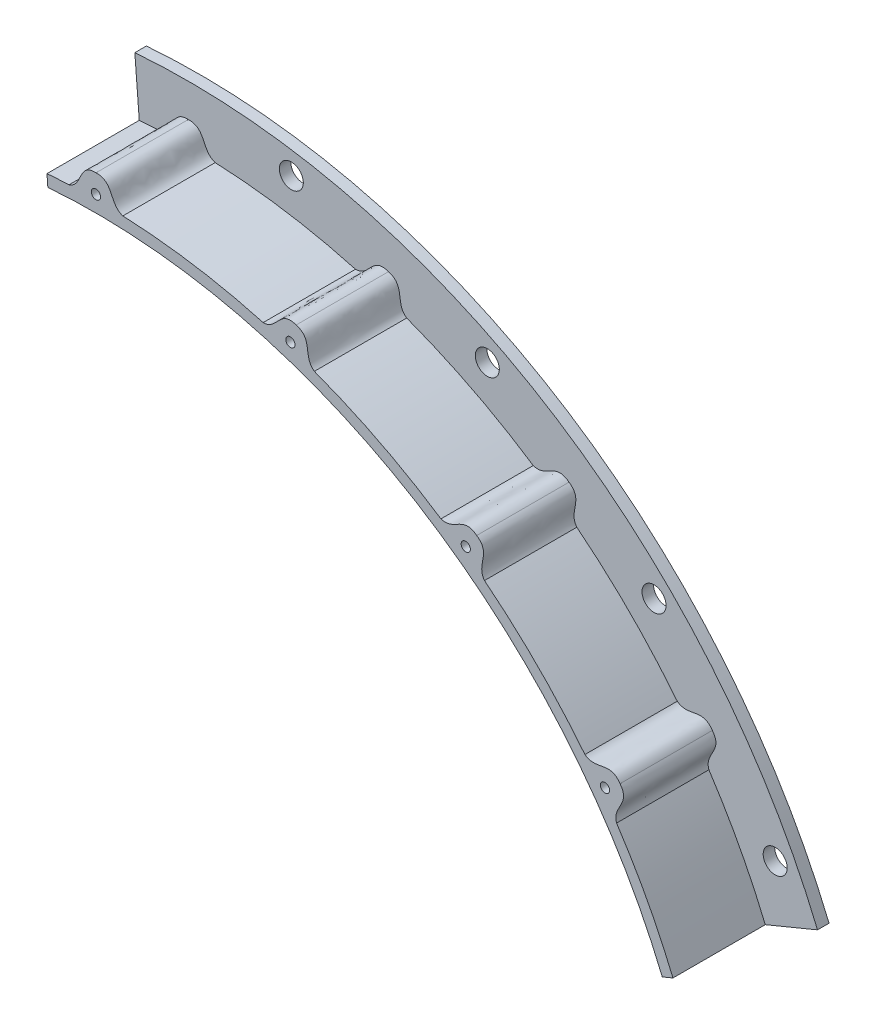
ISO-10303-21;
HEADER;
FILE_DESCRIPTION(('STEP AP214'),'2;1');
FILE_NAME('part.step','',(''),(''),'','','');
FILE_SCHEMA(('AUTOMOTIVE_DESIGN { 1 0 10303 214 1 1 1 1 }'));
ENDSEC;
DATA;
#1=APPLICATION_CONTEXT('core data for automotive mechanical design processes');
#2=APPLICATION_PROTOCOL_DEFINITION('international standard','automotive_design',2000,#1);
#3=PRODUCT_CONTEXT('',#1,'mechanical');
#4=PRODUCT('Part','Part','',(#3));
#5=PRODUCT_RELATED_PRODUCT_CATEGORY('part','',(#4));
#6=PRODUCT_DEFINITION_FORMATION('','',#4);
#7=PRODUCT_DEFINITION_CONTEXT('part definition',#1,'design');
#8=PRODUCT_DEFINITION('design','',#6,#7);
#9=PRODUCT_DEFINITION_SHAPE('','',#8);
#10=(LENGTH_UNIT() NAMED_UNIT(*) SI_UNIT(.MILLI.,.METRE.));
#11=(NAMED_UNIT(*) PLANE_ANGLE_UNIT() SI_UNIT($,.RADIAN.));
#12=(NAMED_UNIT(*) SI_UNIT($,.STERADIAN.) SOLID_ANGLE_UNIT());
#13=UNCERTAINTY_MEASURE_WITH_UNIT(LENGTH_MEASURE(1.E-05),#10,'distance_accuracy_value','');
#14=(GEOMETRIC_REPRESENTATION_CONTEXT(3) GLOBAL_UNCERTAINTY_ASSIGNED_CONTEXT((#13)) GLOBAL_UNIT_ASSIGNED_CONTEXT((#10,
#11,#12)) REPRESENTATION_CONTEXT('',''));
#15=CARTESIAN_POINT('',(0.,0.,0.));
#16=DIRECTION('',(0.,0.,1.));
#17=DIRECTION('',(1.,0.,0.));
#18=AXIS2_PLACEMENT_3D('',#15,#16,#17);
#19=CARTESIAN_POINT('',(0.,0.,3.175));
#20=DIRECTION('',(0.,0.,1.));
#21=DIRECTION('',(1.,0.,0.));
#22=AXIS2_PLACEMENT_3D('',#19,#20,#21);
#23=PLANE('',#22);
#24=CARTESIAN_POINT('',(101.746214957088,140.041650743326,3.175));
#25=DIRECTION('',(0.,0.,1.));
#26=DIRECTION('',(1.,0.,0.));
#27=AXIS2_PLACEMENT_3D('',#24,#25,#26);
#28=CIRCLE('',#27,1.27000000000097);
#29=CARTESIAN_POINT('',(103.016214957089,140.041650743326,3.175));
#30=VERTEX_POINT('',#29);
#31=EDGE_CURVE('E466',#30,#30,#28,.T.);
#32=ORIENTED_EDGE('',*,*,#31,.T.);
#33=EDGE_LOOP('',(#32));
#34=FACE_BOUND('',#33,.T.);
#35=ADVANCED_FACE('F32',(#34),#23,.T.);
#36=CARTESIAN_POINT('',(101.746214957088,140.041650743326,1.27));
#37=DIRECTION('',(0.,0.,1.));
#38=DIRECTION('',(1.,0.,0.));
#39=AXIS2_PLACEMENT_3D('',#36,#37,#38);
#40=CYLINDRICAL_SURFACE('',#39,1.27000000000097);
#41=CARTESIAN_POINT('',(101.746214957088,140.041650743326,28.575));
#42=DIRECTION('',(0.,0.,1.));
#43=DIRECTION('',(1.,0.,0.));
#44=AXIS2_PLACEMENT_3D('',#41,#42,#43);
#45=CIRCLE('',#44,1.27000000000097);
#46=CARTESIAN_POINT('',(103.016214957089,140.041650743326,28.575));
#47=VERTEX_POINT('',#46);
#48=EDGE_CURVE('E519',#47,#47,#45,.T.);
#49=ORIENTED_EDGE('',*,*,#48,.T.);
#50=EDGE_LOOP('',(#49));
#51=FACE_BOUND('',#50,.T.);
#52=ORIENTED_EDGE('',*,*,#31,.F.);
#53=EDGE_LOOP('',(#52));
#54=FACE_BOUND('',#53,.T.);
#55=ADVANCED_FACE('F307',(#51,#54),#40,.F.);
#56=CARTESIAN_POINT('',(140.041650743317,101.746214957118,3.175));
#57=DIRECTION('',(0.,0.,1.));
#58=DIRECTION('',(1.,0.,0.));
#59=AXIS2_PLACEMENT_3D('',#56,#57,#58);
#60=CIRCLE('',#59,1.27000000000818);
#61=CARTESIAN_POINT('',(141.311650743325,101.746214957118,3.175));
#62=VERTEX_POINT('',#61);
#63=EDGE_CURVE('E239',#62,#62,#60,.T.);
#64=ORIENTED_EDGE('',*,*,#63,.T.);
#65=EDGE_LOOP('',(#64));
#66=FACE_BOUND('',#65,.T.);
#67=ADVANCED_FACE('F266',(#66),#23,.T.);
#68=CARTESIAN_POINT('',(140.041650743317,101.746214957118,1.27));
#69=DIRECTION('',(0.,0.,1.));
#70=DIRECTION('',(1.,0.,0.));
#71=AXIS2_PLACEMENT_3D('',#68,#69,#70);
#72=CYLINDRICAL_SURFACE('',#71,1.27000000000818);
#73=CARTESIAN_POINT('',(140.041650743317,101.746214957118,28.575));
#74=DIRECTION('',(0.,0.,1.));
#75=DIRECTION('',(1.,0.,0.));
#76=AXIS2_PLACEMENT_3D('',#73,#74,#75);
#77=CIRCLE('',#76,1.27000000000818);
#78=CARTESIAN_POINT('',(141.311650743325,101.746214957118,28.575));
#79=VERTEX_POINT('',#78);
#80=EDGE_CURVE('E237',#79,#79,#77,.T.);
#81=ORIENTED_EDGE('',*,*,#80,.T.);
#82=EDGE_LOOP('',(#81));
#83=FACE_BOUND('',#82,.T.);
#84=ORIENTED_EDGE('',*,*,#63,.F.);
#85=EDGE_LOOP('',(#84));
#86=FACE_BOUND('',#85,.T.);
#87=ADVANCED_FACE('F262',(#83,#86),#72,.F.);
#88=CARTESIAN_POINT('',(0.,173.101,3.175));
#89=DIRECTION('',(0.,0.,1.));
#90=DIRECTION('',(1.,0.,0.));
#91=AXIS2_PLACEMENT_3D('',#88,#89,#90);
#92=CIRCLE('',#91,1.27);
#93=CARTESIAN_POINT('',(1.27,173.101,3.175));
#94=VERTEX_POINT('',#93);
#95=EDGE_CURVE('E392',#94,#94,#92,.T.);
#96=ORIENTED_EDGE('',*,*,#95,.T.);
#97=EDGE_LOOP('',(#96));
#98=FACE_BOUND('',#97,.T.);
#99=ADVANCED_FACE('F265',(#98),#23,.T.);
#100=CARTESIAN_POINT('',(0.,173.101,1.27));
#101=DIRECTION('',(0.,0.,1.));
#102=DIRECTION('',(1.,0.,0.));
#103=AXIS2_PLACEMENT_3D('',#100,#101,#102);
#104=CYLINDRICAL_SURFACE('',#103,1.27);
#105=CARTESIAN_POINT('',(0.,173.101,28.575));
#106=DIRECTION('',(0.,0.,1.));
#107=DIRECTION('',(1.,0.,0.));
#108=AXIS2_PLACEMENT_3D('',#105,#106,#107);
#109=CIRCLE('',#108,1.27);
#110=CARTESIAN_POINT('',(1.27,173.101,28.575));
#111=VERTEX_POINT('',#110);
#112=EDGE_CURVE('E397',#111,#111,#109,.T.);
#113=ORIENTED_EDGE('',*,*,#112,.T.);
#114=EDGE_LOOP('',(#113));
#115=FACE_BOUND('',#114,.T.);
#116=ORIENTED_EDGE('',*,*,#95,.F.);
#117=EDGE_LOOP('',(#116));
#118=FACE_BOUND('',#117,.T.);
#119=ADVANCED_FACE('F271',(#115,#118),#104,.F.);
#120=CARTESIAN_POINT('',(53.4911507432979,164.628834027207,28.575));
#121=DIRECTION('',(0.,0.,1.));
#122=DIRECTION('',(1.,0.,0.));
#123=AXIS2_PLACEMENT_3D('',#120,#121,#122);
#124=PLANE('',#123);
#125=CARTESIAN_POINT('',(53.4911507433,164.628834027222,28.575));
#126=DIRECTION('',(0.,0.,1.));
#127=DIRECTION('',(1.,0.,0.));
#128=AXIS2_PLACEMENT_3D('',#125,#126,#127);
#129=CIRCLE('',#128,1.26999999999814);
#130=CARTESIAN_POINT('',(54.7611507432982,164.628834027222,28.575));
#131=VERTEX_POINT('',#130);
#132=EDGE_CURVE('E514',#131,#131,#129,.T.);
#133=ORIENTED_EDGE('',*,*,#132,.F.);
#134=EDGE_LOOP('',(#133));
#135=FACE_BOUND('',#134,.T.);
#136=ORIENTED_EDGE('',*,*,#112,.F.);
#137=EDGE_LOOP('',(#136));
#138=FACE_BOUND('',#137,.T.);
#139=CARTESIAN_POINT('',(0.,0.,28.575));
#140=DIRECTION('',(0.,0.,1.));
#141=DIRECTION('',(1.,0.,0.));
#142=AXIS2_PLACEMENT_3D('',#139,#140,#141);
#143=CIRCLE('',#142,171.831);
#144=CARTESIAN_POINT('',(158.751143950947,65.7568768667252,28.575));
#145=VERTEX_POINT('',#144);
#146=CARTESIAN_POINT('',(143.237612225387,94.9151147340747,28.575));
#147=VERTEX_POINT('',#146);
#148=EDGE_CURVE('E200',#145,#147,#143,.T.);
#149=ORIENTED_EDGE('',*,*,#148,.T.);
#150=CARTESIAN_POINT('',(143.237612225387,94.9151147340747,28.575));
#151=CARTESIAN_POINT('',(141.953462812423,98.6504272764381,28.575));
#152=CARTESIAN_POINT('',(147.273074679739,100.866856456998,28.575));
#153=CARTESIAN_POINT('',(144.194459768336,104.763407324454,28.575));
#154=B_SPLINE_CURVE_WITH_KNOTS('',3,(#150,#151,#152,#153),.UNSPECIFIED.,.F.,.F.,(4,4),(0.,1.),.UNSPECIFIED.);
#155=CARTESIAN_POINT('',(144.194459768336,104.763407324454,28.575));
#156=VERTEX_POINT('',#155);
#157=EDGE_CURVE('E41',#147,#156,#154,.T.);
#158=ORIENTED_EDGE('',*,*,#157,.T.);
#159=CARTESIAN_POINT('',(144.194459768336,104.763407324454,28.575));
#160=CARTESIAN_POINT('',(141.439964001522,108.895444534617,28.575));
#161=CARTESIAN_POINT('',(137.688164115939,104.521107287608,28.575));
#162=CARTESIAN_POINT('',(134.532494774054,106.896681009668,28.575));
#163=B_SPLINE_CURVE_WITH_KNOTS('',3,(#159,#160,#161,#162),.UNSPECIFIED.,.F.,.F.,(4,4),(0.,1.),.UNSPECIFIED.);
#164=CARTESIAN_POINT('',(134.532494774054,106.896681009668,28.575));
#165=VERTEX_POINT('',#164);
#166=EDGE_CURVE('E11',#156,#165,#163,.T.);
#167=ORIENTED_EDGE('',*,*,#166,.T.);
#168=CARTESIAN_POINT('',(106.896681009638,134.532494774062,28.575));
#169=VERTEX_POINT('',#168);
#170=EDGE_CURVE('E212',#165,#169,#143,.T.);
#171=ORIENTED_EDGE('',*,*,#170,.T.);
#172=CARTESIAN_POINT('',(106.896681009638,134.532494774062,28.575));
#173=CARTESIAN_POINT('',(104.521107287643,137.688164115959,28.575));
#174=CARTESIAN_POINT('',(108.895444534599,141.439964001522,28.575));
#175=CARTESIAN_POINT('',(104.763407324454,144.194459768336,28.575));
#176=B_SPLINE_CURVE_WITH_KNOTS('',3,(#172,#173,#174,#175),.UNSPECIFIED.,.F.,.F.,(4,4),(0.,1.),.UNSPECIFIED.);
#177=CARTESIAN_POINT('',(104.763407324454,144.194459768336,28.575));
#178=VERTEX_POINT('',#177);
#179=EDGE_CURVE('E476',#169,#178,#176,.T.);
#180=ORIENTED_EDGE('',*,*,#179,.T.);
#181=CARTESIAN_POINT('',(104.763407324454,144.194459768336,28.575));
#182=CARTESIAN_POINT('',(100.866856456989,147.273074679747,28.575));
#183=CARTESIAN_POINT('',(98.6504272764229,141.953462812394,28.575));
#184=CARTESIAN_POINT('',(94.9151147340448,143.237612225396,28.575));
#185=B_SPLINE_CURVE_WITH_KNOTS('',3,(#181,#182,#183,#184),.UNSPECIFIED.,.F.,.F.,(4,4),(0.,1.),.UNSPECIFIED.);
#186=CARTESIAN_POINT('',(94.9151147340448,143.237612225396,28.575));
#187=VERTEX_POINT('',#186);
#188=EDGE_CURVE('E478',#178,#187,#185,.T.);
#189=ORIENTED_EDGE('',*,*,#188,.T.);
#190=CARTESIAN_POINT('',(60.0919578636992,160.980896882557,28.575));
#191=VERTEX_POINT('',#190);
#192=EDGE_CURVE('E207',#187,#191,#143,.T.);
#193=ORIENTED_EDGE('',*,*,#192,.T.);
#194=CARTESIAN_POINT('',(60.0919578636992,160.980896882557,28.575));
#195=CARTESIAN_POINT('',(56.8574975401836,163.248024121961,28.575));
#196=CARTESIAN_POINT('',(59.8583695592363,168.167942399399,28.575));
#197=CARTESIAN_POINT('',(55.0773826420752,169.510753828217,28.575));
#198=B_SPLINE_CURVE_WITH_KNOTS('',3,(#194,#195,#196,#197),.UNSPECIFIED.,.F.,.F.,(4,4),(0.,1.),.UNSPECIFIED.);
#199=CARTESIAN_POINT('',(55.0773826420752,169.510753828217,28.575));
#200=VERTEX_POINT('',#199);
#201=EDGE_CURVE('E501',#191,#200,#198,.T.);
#202=ORIENTED_EDGE('',*,*,#201,.T.);
#203=CARTESIAN_POINT('',(55.0773826420752,169.510753828217,28.575));
#204=CARTESIAN_POINT('',(50.4201982217372,171.234590163375,28.575));
#205=CARTESIAN_POINT('',(49.9560992771343,165.490424349167,28.575));
#206=CARTESIAN_POINT('',(46.0067819513818,165.557447961374,28.575));
#207=B_SPLINE_CURVE_WITH_KNOTS('',3,(#203,#204,#205,#206),.UNSPECIFIED.,.F.,.F.,(4,4),(0.,1.),.UNSPECIFIED.);
#208=CARTESIAN_POINT('',(46.0067819513818,165.557447961374,28.575));
#209=VERTEX_POINT('',#208);
#210=EDGE_CURVE('E502',#200,#209,#207,.T.);
#211=ORIENTED_EDGE('',*,*,#210,.T.);
#212=CARTESIAN_POINT('',(7.40501519677629,171.671367184326,28.575));
#213=VERTEX_POINT('',#212);
#214=EDGE_CURVE('E201',#209,#213,#143,.T.);
#215=ORIENTED_EDGE('',*,*,#214,.T.);
#216=CARTESIAN_POINT('',(7.40501519677629,171.671367184326,28.575));
#217=CARTESIAN_POINT('',(3.62827978401801,172.828030111048,28.575));
#218=CARTESIAN_POINT('',(4.96194031363236,178.43447090027,28.575));
#219=CARTESIAN_POINT('',(0.,178.234154252522,28.575));
#220=B_SPLINE_CURVE_WITH_KNOTS('',3,(#216,#217,#218,#219),.UNSPECIFIED.,.F.,.F.,(4,4),(0.,1.),.UNSPECIFIED.);
#221=CARTESIAN_POINT('',(0.,178.234154252522,28.575));
#222=VERTEX_POINT('',#221);
#223=EDGE_CURVE('E199',#213,#222,#220,.T.);
#224=ORIENTED_EDGE('',*,*,#223,.T.);
#225=CARTESIAN_POINT('',(0.,178.234154252522,28.575));
#226=CARTESIAN_POINT('',(-4.96194031363236,178.43447090027,28.575));
#227=CARTESIAN_POINT('',(-3.62827978401801,172.828030111048,28.575));
#228=CARTESIAN_POINT('',(-7.40501519677629,171.671367184326,28.575));
#229=B_SPLINE_CURVE_WITH_KNOTS('',3,(#225,#226,#227,#228),.UNSPECIFIED.,.F.,.F.,(4,4),(0.,1.),.UNSPECIFIED.);
#230=CARTESIAN_POINT('',(-7.40501519677629,171.671367184326,28.575));
#231=VERTEX_POINT('',#230);
#232=EDGE_CURVE('E504',#222,#231,#229,.T.);
#233=ORIENTED_EDGE('',*,*,#232,.T.);
#234=CARTESIAN_POINT('',(-13.4817048780114,171.301302372697,28.575));
#235=VERTEX_POINT('',#234);
#236=EDGE_CURVE('E198',#231,#235,#143,.T.);
#237=ORIENTED_EDGE('',*,*,#236,.T.);
#238=DIRECTION('',(0.0784590957278451,-0.996917333733128,0.));
#239=VECTOR('',#238,1.);
#240=CARTESIAN_POINT('',(0.,0.,28.575));
#241=LINE('',#240,#239);
#242=CARTESIAN_POINT('',(-13.2325972490754,168.136089838094,28.575));
#243=VERTEX_POINT('',#242);
#244=EDGE_CURVE('E56',#235,#243,#241,.T.);
#245=ORIENTED_EDGE('',*,*,#244,.T.);
#246=CARTESIAN_POINT('',(0.,0.,28.575));
#247=DIRECTION('',(0.,0.,-1.));
#248=DIRECTION('',(-1.,0.,0.));
#249=AXIS2_PLACEMENT_3D('',#246,#247,#248);
#250=CIRCLE('',#249,168.656);
#251=CARTESIAN_POINT('',(155.817826435224,64.541856968966,28.575));
#252=VERTEX_POINT('',#251);
#253=EDGE_CURVE('E204',#243,#252,#250,.T.);
#254=ORIENTED_EDGE('',*,*,#253,.T.);
#255=DIRECTION('',(0.923879532511288,0.382683432365086,0.));
#256=VECTOR('',#255,1.);
#257=CARTESIAN_POINT('',(0.,0.,28.575));
#258=LINE('',#257,#256);
#259=EDGE_CURVE('E36',#252,#145,#258,.T.);
#260=ORIENTED_EDGE('',*,*,#259,.T.);
#261=EDGE_LOOP('',(#149,#158,#167,#171,#180,#189,#193,#202,#211,#215,#224,#233,#237,#245,#254,#260));
#262=FACE_BOUND('',#261,.T.);
#263=ORIENTED_EDGE('',*,*,#48,.F.);
#264=EDGE_LOOP('',(#263));
#265=FACE_BOUND('',#264,.T.);
#266=ORIENTED_EDGE('',*,*,#80,.F.);
#267=EDGE_LOOP('',(#266));
#268=FACE_BOUND('',#267,.T.);
#269=ADVANCED_FACE('F221',(#135,#138,#262,#265,#268),#124,.T.);
#270=CARTESIAN_POINT('',(53.4911507433,164.628834027222,3.175));
#271=DIRECTION('',(0.,0.,1.));
#272=DIRECTION('',(1.,0.,0.));
#273=AXIS2_PLACEMENT_3D('',#270,#271,#272);
#274=CIRCLE('',#273,1.26999999999814);
#275=CARTESIAN_POINT('',(54.7611507432982,164.628834027222,3.175));
#276=VERTEX_POINT('',#275);
#277=EDGE_CURVE('E485',#276,#276,#274,.T.);
#278=ORIENTED_EDGE('',*,*,#277,.T.);
#279=EDGE_LOOP('',(#278));
#280=FACE_BOUND('',#279,.T.);
#281=ADVANCED_FACE('F270',(#280),#23,.T.);
#282=CARTESIAN_POINT('',(53.4911507433,164.628834027222,1.27));
#283=DIRECTION('',(0.,0.,1.));
#284=DIRECTION('',(1.,0.,0.));
#285=AXIS2_PLACEMENT_3D('',#282,#283,#284);
#286=CYLINDRICAL_SURFACE('',#285,1.26999999999814);
#287=ORIENTED_EDGE('',*,*,#132,.T.);
#288=EDGE_LOOP('',(#287));
#289=FACE_BOUND('',#288,.T.);
#290=ORIENTED_EDGE('',*,*,#277,.F.);
#291=EDGE_LOOP('',(#290));
#292=FACE_BOUND('',#291,.T.);
#293=ADVANCED_FACE('F273',(#289,#292),#286,.F.);
#294=CARTESIAN_POINT('',(0.,0.,-0.0100000000000031));
#295=DIRECTION('',(-0.996917333733128,-0.0784590957278451,0.));
#296=DIRECTION('',(0.0784590957278451,-0.996917333733128,0.));
#297=AXIS2_PLACEMENT_3D('',#294,#295,#296);
#298=PLANE('',#297);
#299=ORIENTED_EDGE('',*,*,#244,.F.);
#300=DIRECTION('',(0.,0.,-1.));
#301=VECTOR('',#300,1.);
#302=CARTESIAN_POINT('',(-13.4817048780114,171.301302372697,28.575));
#303=LINE('',#302,#301);
#304=CARTESIAN_POINT('',(-13.4817048780114,171.301302372697,3.175));
#305=VERTEX_POINT('',#304);
#306=EDGE_CURVE('E165',#235,#305,#303,.T.);
#307=ORIENTED_EDGE('',*,*,#306,.T.);
#308=DIRECTION('',(0.0784590957278451,-0.996917333733128,0.));
#309=VECTOR('',#308,1.);
#310=CARTESIAN_POINT('',(0.,0.,3.175));
#311=LINE('',#310,#309);
#312=CARTESIAN_POINT('',(-14.7023322597973,186.81084379225,3.175));
#313=VERTEX_POINT('',#312);
#314=EDGE_CURVE('E175',#313,#305,#311,.T.);
#315=ORIENTED_EDGE('',*,*,#314,.F.);
#316=DIRECTION('',(0.,0.,-1.));
#317=VECTOR('',#316,1.);
#318=CARTESIAN_POINT('',(-14.7023322597973,186.81084379225,3.175));
#319=LINE('',#318,#317);
#320=CARTESIAN_POINT('',(-14.7023322597973,186.81084379225,0.));
#321=VERTEX_POINT('',#320);
#322=EDGE_CURVE('E188',#313,#321,#319,.T.);
#323=ORIENTED_EDGE('',*,*,#322,.T.);
#324=DIRECTION('',(0.0784590957278451,-0.996917333733128,0.));
#325=VECTOR('',#324,1.);
#326=CARTESIAN_POINT('',(0.,0.,0.));
#327=LINE('',#326,#325);
#328=CARTESIAN_POINT('',(-13.2325972490754,168.136089838094,0.));
#329=VERTEX_POINT('',#328);
#330=EDGE_CURVE('E752',#321,#329,#327,.T.);
#331=ORIENTED_EDGE('',*,*,#330,.T.);
#332=DIRECTION('',(0.,0.,-1.));
#333=VECTOR('',#332,1.);
#334=CARTESIAN_POINT('',(-13.2325972490754,168.136089838094,3.175));
#335=LINE('',#334,#333);
#336=EDGE_CURVE('E758',#243,#329,#335,.T.);
#337=ORIENTED_EDGE('',*,*,#336,.F.);
#338=EDGE_LOOP('',(#299,#307,#315,#323,#331,#337));
#339=FACE_BOUND('',#338,.T.);
#340=ADVANCED_FACE('F184',(#339),#298,.T.);
#341=CARTESIAN_POINT('',(0.,0.,-0.0100000000000031));
#342=DIRECTION('',(0.382683432365086,-0.923879532511288,0.));
#343=DIRECTION('',(0.923879532511288,0.382683432365086,0.));
#344=AXIS2_PLACEMENT_3D('',#341,#342,#343);
#345=PLANE('',#344);
#346=ORIENTED_EDGE('',*,*,#259,.F.);
#347=DIRECTION('',(0.,0.,-1.));
#348=VECTOR('',#347,1.);
#349=CARTESIAN_POINT('',(155.817826435224,64.541856968966,3.175));
#350=LINE('',#349,#348);
#351=CARTESIAN_POINT('',(155.817826435224,64.541856968966,0.));
#352=VERTEX_POINT('',#351);
#353=EDGE_CURVE('E194',#352,#252,#350,.F.);
#354=ORIENTED_EDGE('',*,*,#353,.F.);
#355=DIRECTION('',(0.923879532511288,0.382683432365086,0.));
#356=VECTOR('',#355,1.);
#357=CARTESIAN_POINT('',(0.,0.,0.));
#358=LINE('',#357,#356);
#359=CARTESIAN_POINT('',(173.124399777992,71.710474365745,0.));
#360=VERTEX_POINT('',#359);
#361=EDGE_CURVE('E750',#352,#360,#358,.T.);
#362=ORIENTED_EDGE('',*,*,#361,.T.);
#363=DIRECTION('',(0.,0.,-1.));
#364=VECTOR('',#363,1.);
#365=CARTESIAN_POINT('',(173.124399777992,71.710474365745,3.175));
#366=LINE('',#365,#364);
#367=CARTESIAN_POINT('',(173.124399777992,71.710474365745,3.175));
#368=VERTEX_POINT('',#367);
#369=EDGE_CURVE('E185',#360,#368,#366,.F.);
#370=ORIENTED_EDGE('',*,*,#369,.T.);
#371=DIRECTION('',(0.923879532511288,0.382683432365086,0.));
#372=VECTOR('',#371,1.);
#373=CARTESIAN_POINT('',(0.,0.,3.175));
#374=LINE('',#373,#372);
#375=CARTESIAN_POINT('',(158.751143950947,65.7568768667252,3.175));
#376=VERTEX_POINT('',#375);
#377=EDGE_CURVE('E181',#376,#368,#374,.T.);
#378=ORIENTED_EDGE('',*,*,#377,.F.);
#379=DIRECTION('',(0.,0.,-1.));
#380=VECTOR('',#379,1.);
#381=CARTESIAN_POINT('',(158.751143950947,65.7568768667252,28.575));
#382=LINE('',#381,#380);
#383=EDGE_CURVE('E182',#376,#145,#382,.F.);
#384=ORIENTED_EDGE('',*,*,#383,.T.);
#385=EDGE_LOOP('',(#346,#354,#362,#370,#378,#384));
#386=FACE_BOUND('',#385,.T.);
#387=ADVANCED_FACE('F289',(#386),#345,.T.);
#388=CARTESIAN_POINT('',(0.,0.,28.575));
#389=DIRECTION('',(0.,0.,-1.));
#390=DIRECTION('',(-1.,0.,0.));
#391=AXIS2_PLACEMENT_3D('',#388,#389,#390);
#392=CYLINDRICAL_SURFACE('',#391,171.831);
#393=ORIENTED_EDGE('',*,*,#383,.F.);
#394=CARTESIAN_POINT('',(0.,0.,3.175));
#395=DIRECTION('',(0.,0.,1.));
#396=DIRECTION('',(1.,0.,0.));
#397=AXIS2_PLACEMENT_3D('',#394,#395,#396);
#398=CIRCLE('',#397,171.831);
#399=CARTESIAN_POINT('',(143.237612225387,94.9151147340747,3.175));
#400=VERTEX_POINT('',#399);
#401=EDGE_CURVE('E170',#376,#400,#398,.T.);
#402=ORIENTED_EDGE('',*,*,#401,.T.);
#403=DIRECTION('',(0.,0.,1.));
#404=VECTOR('',#403,1.);
#405=CARTESIAN_POINT('',(143.237612225387,94.9151147340747,1.27));
#406=LINE('',#405,#404);
#407=EDGE_CURVE('E228',#400,#147,#406,.T.);
#408=ORIENTED_EDGE('',*,*,#407,.T.);
#409=ORIENTED_EDGE('',*,*,#148,.F.);
#410=EDGE_LOOP('',(#393,#402,#408,#409));
#411=FACE_BOUND('',#410,.T.);
#412=ADVANCED_FACE('F229',(#411),#392,.T.);
#413=CARTESIAN_POINT('',(28.3504616647761,178.997770277716,3.175));
#414=DIRECTION('',(0.,0.,1.));
#415=DIRECTION('',(1.,0.,0.));
#416=AXIS2_PLACEMENT_3D('',#413,#414,#415);
#417=CIRCLE('',#416,3.30199999999999);
#418=CARTESIAN_POINT('',(31.6524616647761,178.997770277716,3.175));
#419=VERTEX_POINT('',#418);
#420=EDGE_CURVE('E772',#419,#419,#417,.T.);
#421=ORIENTED_EDGE('',*,*,#420,.F.);
#422=EDGE_LOOP('',(#421));
#423=FACE_BOUND('',#422,.T.);
#424=CARTESIAN_POINT('',(161.476221372138,82.2762442773039,3.175));
#425=DIRECTION('',(0.,0.,1.));
#426=DIRECTION('',(1.,0.,0.));
#427=AXIS2_PLACEMENT_3D('',#424,#425,#426);
#428=CIRCLE('',#427,3.30200000000161);
#429=CARTESIAN_POINT('',(164.778221372139,82.2762442773039,3.175));
#430=VERTEX_POINT('',#429);
#431=EDGE_CURVE('E775',#430,#430,#428,.T.);
#432=ORIENTED_EDGE('',*,*,#431,.F.);
#433=EDGE_LOOP('',(#432));
#434=FACE_BOUND('',#433,.T.);
#435=CARTESIAN_POINT('',(128.148254847659,128.148254847661,3.175));
#436=DIRECTION('',(0.,0.,1.));
#437=DIRECTION('',(1.,0.,0.));
#438=AXIS2_PLACEMENT_3D('',#435,#436,#437);
#439=CIRCLE('',#438,3.30200000000034);
#440=CARTESIAN_POINT('',(131.450254847659,128.148254847661,3.175));
#441=VERTEX_POINT('',#440);
#442=EDGE_CURVE('E778',#441,#441,#439,.T.);
#443=ORIENTED_EDGE('',*,*,#442,.F.);
#444=EDGE_LOOP('',(#443));
#445=FACE_BOUND('',#444,.T.);
#446=CARTESIAN_POINT('',(82.2762442772985,161.476221372134,3.175));
#447=DIRECTION('',(0.,0.,1.));
#448=DIRECTION('',(1.,0.,0.));
#449=AXIS2_PLACEMENT_3D('',#446,#447,#448);
#450=CIRCLE('',#449,3.302);
#451=CARTESIAN_POINT('',(85.5782442772985,161.476221372134,3.175));
#452=VERTEX_POINT('',#451);
#453=EDGE_CURVE('E780',#452,#452,#450,.T.);
#454=ORIENTED_EDGE('',*,*,#453,.F.);
#455=EDGE_LOOP('',(#454));
#456=FACE_BOUND('',#455,.T.);
#457=CARTESIAN_POINT('',(0.,0.,3.175));
#458=DIRECTION('',(0.,0.,1.));
#459=DIRECTION('',(1.,0.,0.));
#460=AXIS2_PLACEMENT_3D('',#457,#458,#459);
#461=CIRCLE('',#460,187.3885);
#462=EDGE_CURVE('E178',#368,#313,#461,.T.);
#463=ORIENTED_EDGE('',*,*,#462,.T.);
#464=ORIENTED_EDGE('',*,*,#314,.T.);
#465=CARTESIAN_POINT('',(-7.40501519677629,171.671367184326,3.175));
#466=VERTEX_POINT('',#465);
#467=EDGE_CURVE('E162',#466,#305,#398,.T.);
#468=ORIENTED_EDGE('',*,*,#467,.F.);
#469=CARTESIAN_POINT('',(0.,178.234154252522,3.175));
#470=CARTESIAN_POINT('',(-4.96194031363236,178.43447090027,3.175));
#471=CARTESIAN_POINT('',(-3.62827978401801,172.828030111048,3.175));
#472=CARTESIAN_POINT('',(-7.40501519677629,171.671367184326,3.175));
#473=B_SPLINE_CURVE_WITH_KNOTS('',3,(#469,#470,#471,#472),.UNSPECIFIED.,.F.,.F.,(4,4),(0.,1.),.UNSPECIFIED.);
#474=CARTESIAN_POINT('',(0.,178.234154252522,3.175));
#475=VERTEX_POINT('',#474);
#476=EDGE_CURVE('E384',#475,#466,#473,.T.);
#477=ORIENTED_EDGE('',*,*,#476,.F.);
#478=CARTESIAN_POINT('',(7.40501519677629,171.671367184326,3.175));
#479=CARTESIAN_POINT('',(3.62827978401801,172.828030111048,3.175));
#480=CARTESIAN_POINT('',(4.96194031363236,178.43447090027,3.175));
#481=CARTESIAN_POINT('',(0.,178.234154252522,3.175));
#482=B_SPLINE_CURVE_WITH_KNOTS('',3,(#478,#479,#480,#481),.UNSPECIFIED.,.F.,.F.,(4,4),(0.,1.),.UNSPECIFIED.);
#483=CARTESIAN_POINT('',(7.40501519677629,171.671367184326,3.175));
#484=VERTEX_POINT('',#483);
#485=EDGE_CURVE('E388',#484,#475,#482,.T.);
#486=ORIENTED_EDGE('',*,*,#485,.F.);
#487=CARTESIAN_POINT('',(46.0067819513818,165.557447961374,3.175));
#488=VERTEX_POINT('',#487);
#489=EDGE_CURVE('E173',#488,#484,#398,.T.);
#490=ORIENTED_EDGE('',*,*,#489,.F.);
#491=CARTESIAN_POINT('',(55.0773826420752,169.510753828217,3.175));
#492=CARTESIAN_POINT('',(50.4201982217372,171.234590163375,3.175));
#493=CARTESIAN_POINT('',(49.9560992771343,165.490424349167,3.175));
#494=CARTESIAN_POINT('',(46.0067819513818,165.557447961374,3.175));
#495=B_SPLINE_CURVE_WITH_KNOTS('',3,(#491,#492,#493,#494),.UNSPECIFIED.,.F.,.F.,(4,4),(0.,1.),.UNSPECIFIED.);
#496=CARTESIAN_POINT('',(55.0773826420752,169.510753828217,3.175));
#497=VERTEX_POINT('',#496);
#498=EDGE_CURVE('E412',#497,#488,#495,.T.);
#499=ORIENTED_EDGE('',*,*,#498,.F.);
#500=CARTESIAN_POINT('',(60.0919578636992,160.980896882557,3.175));
#501=CARTESIAN_POINT('',(56.8574975401836,163.248024121961,3.175));
#502=CARTESIAN_POINT('',(59.8583695592363,168.167942399399,3.175));
#503=CARTESIAN_POINT('',(55.0773826420752,169.510753828217,3.175));
#504=B_SPLINE_CURVE_WITH_KNOTS('',3,(#500,#501,#502,#503),.UNSPECIFIED.,.F.,.F.,(4,4),(0.,1.),.UNSPECIFIED.);
#505=CARTESIAN_POINT('',(60.0919578636992,160.980896882557,3.175));
#506=VERTEX_POINT('',#505);
#507=EDGE_CURVE('E481',#506,#497,#504,.T.);
#508=ORIENTED_EDGE('',*,*,#507,.F.);
#509=CARTESIAN_POINT('',(94.9151147340448,143.237612225396,3.175));
#510=VERTEX_POINT('',#509);
#511=EDGE_CURVE('E379',#510,#506,#398,.T.);
#512=ORIENTED_EDGE('',*,*,#511,.F.);
#513=CARTESIAN_POINT('',(104.763407324454,144.194459768336,3.175));
#514=CARTESIAN_POINT('',(100.866856456989,147.273074679747,3.175));
#515=CARTESIAN_POINT('',(98.6504272764229,141.953462812394,3.175));
#516=CARTESIAN_POINT('',(94.9151147340448,143.237612225396,3.175));
#517=B_SPLINE_CURVE_WITH_KNOTS('',3,(#513,#514,#515,#516),.UNSPECIFIED.,.F.,.F.,(4,4),(0.,1.),.UNSPECIFIED.);
#518=CARTESIAN_POINT('',(104.763407324454,144.194459768336,3.175));
#519=VERTEX_POINT('',#518);
#520=EDGE_CURVE('E452',#519,#510,#517,.T.);
#521=ORIENTED_EDGE('',*,*,#520,.F.);
#522=CARTESIAN_POINT('',(106.896681009638,134.532494774062,3.175));
#523=CARTESIAN_POINT('',(104.521107287643,137.688164115959,3.175));
#524=CARTESIAN_POINT('',(108.895444534599,141.439964001522,3.175));
#525=CARTESIAN_POINT('',(104.763407324454,144.194459768336,3.175));
#526=B_SPLINE_CURVE_WITH_KNOTS('',3,(#522,#523,#524,#525),.UNSPECIFIED.,.F.,.F.,(4,4),(0.,1.),.UNSPECIFIED.);
#527=CARTESIAN_POINT('',(106.896681009638,134.532494774062,3.175));
#528=VERTEX_POINT('',#527);
#529=EDGE_CURVE('E376',#528,#519,#526,.T.);
#530=ORIENTED_EDGE('',*,*,#529,.F.);
#531=CARTESIAN_POINT('',(134.532494774054,106.896681009668,3.175));
#532=VERTEX_POINT('',#531);
#533=EDGE_CURVE('E374',#532,#528,#398,.T.);
#534=ORIENTED_EDGE('',*,*,#533,.F.);
#535=CARTESIAN_POINT('',(144.194459768336,104.763407324454,3.175));
#536=CARTESIAN_POINT('',(141.439964001522,108.895444534617,3.175));
#537=CARTESIAN_POINT('',(137.688164115939,104.521107287608,3.175));
#538=CARTESIAN_POINT('',(134.532494774054,106.896681009668,3.175));
#539=B_SPLINE_CURVE_WITH_KNOTS('',3,(#535,#536,#537,#538),.UNSPECIFIED.,.F.,.F.,(4,4),(0.,1.),.UNSPECIFIED.);
#540=CARTESIAN_POINT('',(144.194459768336,104.763407324454,3.175));
#541=VERTEX_POINT('',#540);
#542=EDGE_CURVE('E348',#541,#532,#539,.T.);
#543=ORIENTED_EDGE('',*,*,#542,.F.);
#544=CARTESIAN_POINT('',(143.237612225387,94.9151147340747,3.175));
#545=CARTESIAN_POINT('',(141.953462812423,98.6504272764381,3.175));
#546=CARTESIAN_POINT('',(147.273074679739,100.866856456998,3.175));
#547=CARTESIAN_POINT('',(144.194459768336,104.763407324454,3.175));
#548=B_SPLINE_CURVE_WITH_KNOTS('',3,(#544,#545,#546,#547),.UNSPECIFIED.,.F.,.F.,(4,4),(0.,1.),.UNSPECIFIED.);
#549=EDGE_CURVE('E355',#400,#541,#548,.T.);
#550=ORIENTED_EDGE('',*,*,#549,.F.);
#551=ORIENTED_EDGE('',*,*,#401,.F.);
#552=ORIENTED_EDGE('',*,*,#377,.T.);
#553=EDGE_LOOP('',(#463,#464,#468,#477,#486,#490,#499,#508,#512,#521,#530,#534,#543,#550,#551,#552));
#554=FACE_BOUND('',#553,.T.);
#555=ADVANCED_FACE('F176',(#423,#434,#445,#456,#554),#23,.T.);
#556=CARTESIAN_POINT('',(0.,0.,0.));
#557=DIRECTION('',(0.,0.,1.));
#558=DIRECTION('',(1.,0.,0.));
#559=AXIS2_PLACEMENT_3D('',#556,#557,#558);
#560=PLANE('',#559);
#561=CARTESIAN_POINT('',(28.3504616647761,178.997770277716,0.));
#562=DIRECTION('',(0.,0.,1.));
#563=DIRECTION('',(1.,0.,0.));
#564=AXIS2_PLACEMENT_3D('',#561,#562,#563);
#565=CIRCLE('',#564,3.30199999999999);
#566=CARTESIAN_POINT('',(31.6524616647761,178.997770277716,0.));
#567=VERTEX_POINT('',#566);
#568=EDGE_CURVE('E765',#567,#567,#565,.T.);
#569=ORIENTED_EDGE('',*,*,#568,.T.);
#570=EDGE_LOOP('',(#569));
#571=FACE_BOUND('',#570,.T.);
#572=CARTESIAN_POINT('',(161.476221372138,82.2762442773039,0.));
#573=DIRECTION('',(0.,0.,1.));
#574=DIRECTION('',(1.,0.,0.));
#575=AXIS2_PLACEMENT_3D('',#572,#573,#574);
#576=CIRCLE('',#575,3.30200000000161);
#577=CARTESIAN_POINT('',(164.778221372139,82.2762442773039,0.));
#578=VERTEX_POINT('',#577);
#579=EDGE_CURVE('E203',#578,#578,#576,.T.);
#580=ORIENTED_EDGE('',*,*,#579,.T.);
#581=EDGE_LOOP('',(#580));
#582=FACE_BOUND('',#581,.T.);
#583=CARTESIAN_POINT('',(128.148254847659,128.148254847661,0.));
#584=DIRECTION('',(0.,0.,1.));
#585=DIRECTION('',(1.,0.,0.));
#586=AXIS2_PLACEMENT_3D('',#583,#584,#585);
#587=CIRCLE('',#586,3.30200000000034);
#588=CARTESIAN_POINT('',(131.450254847659,128.148254847661,0.));
#589=VERTEX_POINT('',#588);
#590=EDGE_CURVE('E764',#589,#589,#587,.T.);
#591=ORIENTED_EDGE('',*,*,#590,.T.);
#592=EDGE_LOOP('',(#591));
#593=FACE_BOUND('',#592,.T.);
#594=CARTESIAN_POINT('',(82.2762442772985,161.476221372134,0.));
#595=DIRECTION('',(0.,0.,1.));
#596=DIRECTION('',(1.,0.,0.));
#597=AXIS2_PLACEMENT_3D('',#594,#595,#596);
#598=CIRCLE('',#597,3.302);
#599=CARTESIAN_POINT('',(85.5782442772985,161.476221372134,0.));
#600=VERTEX_POINT('',#599);
#601=EDGE_CURVE('E761',#600,#600,#598,.T.);
#602=ORIENTED_EDGE('',*,*,#601,.T.);
#603=EDGE_LOOP('',(#602));
#604=FACE_BOUND('',#603,.T.);
#605=ORIENTED_EDGE('',*,*,#330,.F.);
#606=CARTESIAN_POINT('',(0.,0.,0.));
#607=DIRECTION('',(0.,0.,1.));
#608=DIRECTION('',(1.,0.,0.));
#609=AXIS2_PLACEMENT_3D('',#606,#607,#608);
#610=CIRCLE('',#609,187.3885);
#611=EDGE_CURVE('E193',#360,#321,#610,.T.);
#612=ORIENTED_EDGE('',*,*,#611,.F.);
#613=ORIENTED_EDGE('',*,*,#361,.F.);
#614=CARTESIAN_POINT('',(0.,0.,0.));
#615=DIRECTION('',(0.,0.,1.));
#616=DIRECTION('',(1.,0.,0.));
#617=AXIS2_PLACEMENT_3D('',#614,#615,#616);
#618=CIRCLE('',#617,168.656);
#619=EDGE_CURVE('E171',#352,#329,#618,.T.);
#620=ORIENTED_EDGE('',*,*,#619,.T.);
#621=EDGE_LOOP('',(#605,#612,#613,#620));
#622=FACE_BOUND('',#621,.T.);
#623=ADVANCED_FACE('F297',(#571,#582,#593,#604,#622),#560,.F.);
#624=CARTESIAN_POINT('',(0.,0.,3.175));
#625=DIRECTION('',(0.,0.,-1.));
#626=DIRECTION('',(-1.,0.,0.));
#627=AXIS2_PLACEMENT_3D('',#624,#625,#626);
#628=CYLINDRICAL_SURFACE('',#627,187.3885);
#629=ORIENTED_EDGE('',*,*,#322,.F.);
#630=ORIENTED_EDGE('',*,*,#462,.F.);
#631=ORIENTED_EDGE('',*,*,#369,.F.);
#632=ORIENTED_EDGE('',*,*,#611,.T.);
#633=EDGE_LOOP('',(#629,#630,#631,#632));
#634=FACE_BOUND('',#633,.T.);
#635=ADVANCED_FACE('F34',(#634),#628,.T.);
#636=CARTESIAN_POINT('',(0.,0.,3.175));
#637=DIRECTION('',(0.,0.,-1.));
#638=DIRECTION('',(-1.,0.,0.));
#639=AXIS2_PLACEMENT_3D('',#636,#637,#638);
#640=CYLINDRICAL_SURFACE('',#639,168.656);
#641=ORIENTED_EDGE('',*,*,#253,.F.);
#642=ORIENTED_EDGE('',*,*,#336,.T.);
#643=ORIENTED_EDGE('',*,*,#619,.F.);
#644=ORIENTED_EDGE('',*,*,#353,.T.);
#645=EDGE_LOOP('',(#641,#642,#643,#644));
#646=FACE_BOUND('',#645,.T.);
#647=ADVANCED_FACE('F302',(#646),#640,.F.);
#648=ORIENTED_EDGE('',*,*,#306,.F.);
#649=ORIENTED_EDGE('',*,*,#236,.F.);
#650=DIRECTION('',(0.,0.,1.));
#651=VECTOR('',#650,1.);
#652=CARTESIAN_POINT('',(-7.40501519677629,171.671367184326,1.27));
#653=LINE('',#652,#651);
#654=EDGE_CURVE('E167',#466,#231,#653,.T.);
#655=ORIENTED_EDGE('',*,*,#654,.F.);
#656=ORIENTED_EDGE('',*,*,#467,.T.);
#657=EDGE_LOOP('',(#648,#649,#655,#656));
#658=FACE_BOUND('',#657,.T.);
#659=ADVANCED_FACE('F164',(#658),#392,.T.);
#660=ORIENTED_EDGE('',*,*,#170,.F.);
#661=DIRECTION('',(0.,0.,1.));
#662=VECTOR('',#661,1.);
#663=CARTESIAN_POINT('',(134.532494774054,106.896681009668,1.27));
#664=LINE('',#663,#662);
#665=EDGE_CURVE('E233',#532,#165,#664,.T.);
#666=ORIENTED_EDGE('',*,*,#665,.F.);
#667=ORIENTED_EDGE('',*,*,#533,.T.);
#668=DIRECTION('',(0.,0.,1.));
#669=VECTOR('',#668,1.);
#670=CARTESIAN_POINT('',(106.896681009638,134.532494774062,1.27));
#671=LINE('',#670,#669);
#672=EDGE_CURVE('E473',#528,#169,#671,.T.);
#673=ORIENTED_EDGE('',*,*,#672,.T.);
#674=EDGE_LOOP('',(#660,#666,#667,#673));
#675=FACE_BOUND('',#674,.T.);
#676=ADVANCED_FACE('F315',(#675),#392,.T.);
#677=ORIENTED_EDGE('',*,*,#192,.F.);
#678=DIRECTION('',(0.,0.,1.));
#679=VECTOR('',#678,1.);
#680=CARTESIAN_POINT('',(94.9151147340448,143.237612225396,1.27));
#681=LINE('',#680,#679);
#682=EDGE_CURVE('E356',#510,#187,#681,.T.);
#683=ORIENTED_EDGE('',*,*,#682,.F.);
#684=ORIENTED_EDGE('',*,*,#511,.T.);
#685=DIRECTION('',(0.,0.,1.));
#686=VECTOR('',#685,1.);
#687=CARTESIAN_POINT('',(60.0919578636992,160.980896882557,1.27));
#688=LINE('',#687,#686);
#689=EDGE_CURVE('E500',#506,#191,#688,.T.);
#690=ORIENTED_EDGE('',*,*,#689,.T.);
#691=EDGE_LOOP('',(#677,#683,#684,#690));
#692=FACE_BOUND('',#691,.T.);
#693=ADVANCED_FACE('F312',(#692),#392,.T.);
#694=ORIENTED_EDGE('',*,*,#214,.F.);
#695=DIRECTION('',(0.,0.,1.));
#696=VECTOR('',#695,1.);
#697=CARTESIAN_POINT('',(46.0067819513818,165.557447961374,1.27));
#698=LINE('',#697,#696);
#699=EDGE_CURVE('E459',#488,#209,#698,.T.);
#700=ORIENTED_EDGE('',*,*,#699,.F.);
#701=ORIENTED_EDGE('',*,*,#489,.T.);
#702=DIRECTION('',(0.,0.,1.));
#703=VECTOR('',#702,1.);
#704=CARTESIAN_POINT('',(7.40501519677629,171.671367184326,1.27));
#705=LINE('',#704,#703);
#706=EDGE_CURVE('E413',#484,#213,#705,.T.);
#707=ORIENTED_EDGE('',*,*,#706,.T.);
#708=EDGE_LOOP('',(#694,#700,#701,#707));
#709=FACE_BOUND('',#708,.T.);
#710=ADVANCED_FACE('F306',(#709),#392,.T.);
#711=CARTESIAN_POINT('',(0.,178.234154252522,1.27));
#712=CARTESIAN_POINT('',(-4.96194031363236,178.43447090027,1.27));
#713=CARTESIAN_POINT('',(-3.62827978401801,172.828030111048,1.27));
#714=CARTESIAN_POINT('',(-7.40501519677629,171.671367184326,1.27));
#715=B_SPLINE_CURVE_WITH_KNOTS('',3,(#711,#712,#713,#714),.UNSPECIFIED.,.F.,.F.,(4,4),(0.,1.),.UNSPECIFIED.);
#716=DIRECTION('',(0.,0.,1.));
#717=VECTOR('',#716,1.);
#718=SURFACE_OF_LINEAR_EXTRUSION('',#715,#717);
#719=DIRECTION('',(0.,0.,1.));
#720=VECTOR('',#719,1.);
#721=CARTESIAN_POINT('',(0.,178.234154252522,1.27));
#722=LINE('',#721,#720);
#723=EDGE_CURVE('E410',#475,#222,#722,.T.);
#724=ORIENTED_EDGE('',*,*,#723,.F.);
#725=ORIENTED_EDGE('',*,*,#476,.T.);
#726=ORIENTED_EDGE('',*,*,#654,.T.);
#727=ORIENTED_EDGE('',*,*,#232,.F.);
#728=EDGE_LOOP('',(#724,#725,#726,#727));
#729=FACE_BOUND('',#728,.T.);
#730=ADVANCED_FACE('F311',(#729),#718,.T.);
#731=CARTESIAN_POINT('',(7.40501519677629,171.671367184326,1.27));
#732=CARTESIAN_POINT('',(3.62827978401801,172.828030111048,1.27));
#733=CARTESIAN_POINT('',(4.96194031363236,178.43447090027,1.27));
#734=CARTESIAN_POINT('',(0.,178.234154252522,1.27));
#735=B_SPLINE_CURVE_WITH_KNOTS('',3,(#731,#732,#733,#734),.UNSPECIFIED.,.F.,.F.,(4,4),(0.,1.),.UNSPECIFIED.);
#736=DIRECTION('',(0.,0.,1.));
#737=VECTOR('',#736,1.);
#738=SURFACE_OF_LINEAR_EXTRUSION('',#735,#737);
#739=ORIENTED_EDGE('',*,*,#706,.F.);
#740=ORIENTED_EDGE('',*,*,#485,.T.);
#741=ORIENTED_EDGE('',*,*,#723,.T.);
#742=ORIENTED_EDGE('',*,*,#223,.F.);
#743=EDGE_LOOP('',(#739,#740,#741,#742));
#744=FACE_BOUND('',#743,.T.);
#745=ADVANCED_FACE('F429',(#744),#738,.T.);
#746=CARTESIAN_POINT('',(55.0773826420752,169.510753828217,1.27));
#747=CARTESIAN_POINT('',(50.4201982217372,171.234590163375,1.27));
#748=CARTESIAN_POINT('',(49.9560992771343,165.490424349167,1.27));
#749=CARTESIAN_POINT('',(46.0067819513818,165.557447961374,1.27));
#750=B_SPLINE_CURVE_WITH_KNOTS('',3,(#746,#747,#748,#749),.UNSPECIFIED.,.F.,.F.,(4,4),(0.,1.),.UNSPECIFIED.);
#751=DIRECTION('',(0.,0.,1.));
#752=VECTOR('',#751,1.);
#753=SURFACE_OF_LINEAR_EXTRUSION('',#750,#752);
#754=DIRECTION('',(0.,0.,1.));
#755=VECTOR('',#754,1.);
#756=CARTESIAN_POINT('',(55.0773826420752,169.510753828217,1.27));
#757=LINE('',#756,#755);
#758=EDGE_CURVE('E488',#497,#200,#757,.T.);
#759=ORIENTED_EDGE('',*,*,#758,.F.);
#760=ORIENTED_EDGE('',*,*,#498,.T.);
#761=ORIENTED_EDGE('',*,*,#699,.T.);
#762=ORIENTED_EDGE('',*,*,#210,.F.);
#763=EDGE_LOOP('',(#759,#760,#761,#762));
#764=FACE_BOUND('',#763,.T.);
#765=ADVANCED_FACE('F433',(#764),#753,.T.);
#766=CARTESIAN_POINT('',(60.0919578636992,160.980896882557,1.27));
#767=CARTESIAN_POINT('',(56.8574975401836,163.248024121961,1.27));
#768=CARTESIAN_POINT('',(59.8583695592363,168.167942399399,1.27));
#769=CARTESIAN_POINT('',(55.0773826420752,169.510753828217,1.27));
#770=B_SPLINE_CURVE_WITH_KNOTS('',3,(#766,#767,#768,#769),.UNSPECIFIED.,.F.,.F.,(4,4),(0.,1.),.UNSPECIFIED.);
#771=DIRECTION('',(0.,0.,1.));
#772=VECTOR('',#771,1.);
#773=SURFACE_OF_LINEAR_EXTRUSION('',#770,#772);
#774=ORIENTED_EDGE('',*,*,#689,.F.);
#775=ORIENTED_EDGE('',*,*,#507,.T.);
#776=ORIENTED_EDGE('',*,*,#758,.T.);
#777=ORIENTED_EDGE('',*,*,#201,.F.);
#778=EDGE_LOOP('',(#774,#775,#776,#777));
#779=FACE_BOUND('',#778,.T.);
#780=ADVANCED_FACE('F441',(#779),#773,.T.);
#781=CARTESIAN_POINT('',(104.763407324454,144.194459768336,1.27));
#782=CARTESIAN_POINT('',(100.866856456989,147.273074679747,1.27));
#783=CARTESIAN_POINT('',(98.6504272764229,141.953462812394,1.27));
#784=CARTESIAN_POINT('',(94.9151147340448,143.237612225396,1.27));
#785=B_SPLINE_CURVE_WITH_KNOTS('',3,(#781,#782,#783,#784),.UNSPECIFIED.,.F.,.F.,(4,4),(0.,1.),.UNSPECIFIED.);
#786=DIRECTION('',(0.,0.,1.));
#787=VECTOR('',#786,1.);
#788=SURFACE_OF_LINEAR_EXTRUSION('',#785,#787);
#789=DIRECTION('',(0.,0.,1.));
#790=VECTOR('',#789,1.);
#791=CARTESIAN_POINT('',(104.763407324454,144.194459768336,1.27));
#792=LINE('',#791,#790);
#793=EDGE_CURVE('E339',#519,#178,#792,.T.);
#794=ORIENTED_EDGE('',*,*,#793,.F.);
#795=ORIENTED_EDGE('',*,*,#520,.T.);
#796=ORIENTED_EDGE('',*,*,#682,.T.);
#797=ORIENTED_EDGE('',*,*,#188,.F.);
#798=EDGE_LOOP('',(#794,#795,#796,#797));
#799=FACE_BOUND('',#798,.T.);
#800=ADVANCED_FACE('F331',(#799),#788,.T.);
#801=CARTESIAN_POINT('',(106.896681009638,134.532494774062,1.27));
#802=CARTESIAN_POINT('',(104.521107287643,137.688164115959,1.27));
#803=CARTESIAN_POINT('',(108.895444534599,141.439964001522,1.27));
#804=CARTESIAN_POINT('',(104.763407324454,144.194459768336,1.27));
#805=B_SPLINE_CURVE_WITH_KNOTS('',3,(#801,#802,#803,#804),.UNSPECIFIED.,.F.,.F.,(4,4),(0.,1.),.UNSPECIFIED.);
#806=DIRECTION('',(0.,0.,1.));
#807=VECTOR('',#806,1.);
#808=SURFACE_OF_LINEAR_EXTRUSION('',#805,#807);
#809=ORIENTED_EDGE('',*,*,#672,.F.);
#810=ORIENTED_EDGE('',*,*,#529,.T.);
#811=ORIENTED_EDGE('',*,*,#793,.T.);
#812=ORIENTED_EDGE('',*,*,#179,.F.);
#813=EDGE_LOOP('',(#809,#810,#811,#812));
#814=FACE_BOUND('',#813,.T.);
#815=ADVANCED_FACE('F327',(#814),#808,.T.);
#816=CARTESIAN_POINT('',(144.194459768336,104.763407324454,1.27));
#817=CARTESIAN_POINT('',(141.439964001522,108.895444534617,1.27));
#818=CARTESIAN_POINT('',(137.688164115939,104.521107287608,1.27));
#819=CARTESIAN_POINT('',(134.532494774054,106.896681009668,1.27));
#820=B_SPLINE_CURVE_WITH_KNOTS('',3,(#816,#817,#818,#819),.UNSPECIFIED.,.F.,.F.,(4,4),(0.,1.),.UNSPECIFIED.);
#821=DIRECTION('',(0.,0.,1.));
#822=VECTOR('',#821,1.);
#823=SURFACE_OF_LINEAR_EXTRUSION('',#820,#822);
#824=DIRECTION('',(0.,0.,1.));
#825=VECTOR('',#824,1.);
#826=CARTESIAN_POINT('',(144.194459768336,104.763407324454,1.27));
#827=LINE('',#826,#825);
#828=EDGE_CURVE('E234',#541,#156,#827,.T.);
#829=ORIENTED_EDGE('',*,*,#828,.F.);
#830=ORIENTED_EDGE('',*,*,#542,.T.);
#831=ORIENTED_EDGE('',*,*,#665,.T.);
#832=ORIENTED_EDGE('',*,*,#166,.F.);
#833=EDGE_LOOP('',(#829,#830,#831,#832));
#834=FACE_BOUND('',#833,.T.);
#835=ADVANCED_FACE('F260',(#834),#823,.T.);
#836=CARTESIAN_POINT('',(143.237612225387,94.9151147340747,1.27));
#837=CARTESIAN_POINT('',(141.953462812423,98.6504272764381,1.27));
#838=CARTESIAN_POINT('',(147.273074679739,100.866856456998,1.27));
#839=CARTESIAN_POINT('',(144.194459768336,104.763407324454,1.27));
#840=B_SPLINE_CURVE_WITH_KNOTS('',3,(#836,#837,#838,#839),.UNSPECIFIED.,.F.,.F.,(4,4),(0.,1.),.UNSPECIFIED.);
#841=DIRECTION('',(0.,0.,1.));
#842=VECTOR('',#841,1.);
#843=SURFACE_OF_LINEAR_EXTRUSION('',#840,#842);
#844=ORIENTED_EDGE('',*,*,#407,.F.);
#845=ORIENTED_EDGE('',*,*,#549,.T.);
#846=ORIENTED_EDGE('',*,*,#828,.T.);
#847=ORIENTED_EDGE('',*,*,#157,.F.);
#848=EDGE_LOOP('',(#844,#845,#846,#847));
#849=FACE_BOUND('',#848,.T.);
#850=ADVANCED_FACE('F255',(#849),#843,.T.);
#851=CARTESIAN_POINT('',(28.3504616647761,178.997770277716,0.));
#852=DIRECTION('',(0.,0.,1.));
#853=DIRECTION('',(1.,0.,0.));
#854=AXIS2_PLACEMENT_3D('',#851,#852,#853);
#855=CYLINDRICAL_SURFACE('',#854,3.30199999999999);
#856=ORIENTED_EDGE('',*,*,#420,.T.);
#857=EDGE_LOOP('',(#856));
#858=FACE_BOUND('',#857,.T.);
#859=ORIENTED_EDGE('',*,*,#568,.F.);
#860=EDGE_LOOP('',(#859));
#861=FACE_BOUND('',#860,.T.);
#862=ADVANCED_FACE('F259',(#858,#861),#855,.F.);
#863=CARTESIAN_POINT('',(161.476221372138,82.2762442773039,0.));
#864=DIRECTION('',(0.,0.,1.));
#865=DIRECTION('',(1.,0.,0.));
#866=AXIS2_PLACEMENT_3D('',#863,#864,#865);
#867=CYLINDRICAL_SURFACE('',#866,3.30200000000161);
#868=ORIENTED_EDGE('',*,*,#431,.T.);
#869=EDGE_LOOP('',(#868));
#870=FACE_BOUND('',#869,.T.);
#871=ORIENTED_EDGE('',*,*,#579,.F.);
#872=EDGE_LOOP('',(#871));
#873=FACE_BOUND('',#872,.T.);
#874=ADVANCED_FACE('F276',(#870,#873),#867,.F.);
#875=CARTESIAN_POINT('',(128.148254847659,128.148254847661,0.));
#876=DIRECTION('',(0.,0.,1.));
#877=DIRECTION('',(1.,0.,0.));
#878=AXIS2_PLACEMENT_3D('',#875,#876,#877);
#879=CYLINDRICAL_SURFACE('',#878,3.30200000000034);
#880=ORIENTED_EDGE('',*,*,#442,.T.);
#881=EDGE_LOOP('',(#880));
#882=FACE_BOUND('',#881,.T.);
#883=ORIENTED_EDGE('',*,*,#590,.F.);
#884=EDGE_LOOP('',(#883));
#885=FACE_BOUND('',#884,.T.);
#886=ADVANCED_FACE('F280',(#882,#885),#879,.F.);
#887=CARTESIAN_POINT('',(82.2762442772985,161.476221372134,0.));
#888=DIRECTION('',(0.,0.,1.));
#889=DIRECTION('',(1.,0.,0.));
#890=AXIS2_PLACEMENT_3D('',#887,#888,#889);
#891=CYLINDRICAL_SURFACE('',#890,3.302);
#892=ORIENTED_EDGE('',*,*,#453,.T.);
#893=EDGE_LOOP('',(#892));
#894=FACE_BOUND('',#893,.T.);
#895=ORIENTED_EDGE('',*,*,#601,.F.);
#896=EDGE_LOOP('',(#895));
#897=FACE_BOUND('',#896,.T.);
#898=ADVANCED_FACE('F284',(#894,#897),#891,.F.);
#899=CLOSED_SHELL('',(#35,#55,#67,#87,#99,#119,#269,#281,#293,#340,#387,#412,#555,#623,#635,
#647,#659,#676,#693,#710,#730,#745,#765,#780,#800,#815,#835,#850,#862,#874,#886,#898));
#900=MANIFOLD_SOLID_BREP('B2',#899);
#901=ADVANCED_BREP_SHAPE_REPRESENTATION('',(#18,#900),#14);
#902=SHAPE_DEFINITION_REPRESENTATION(#9,#901);
ENDSEC;
END-ISO-10303-21;
